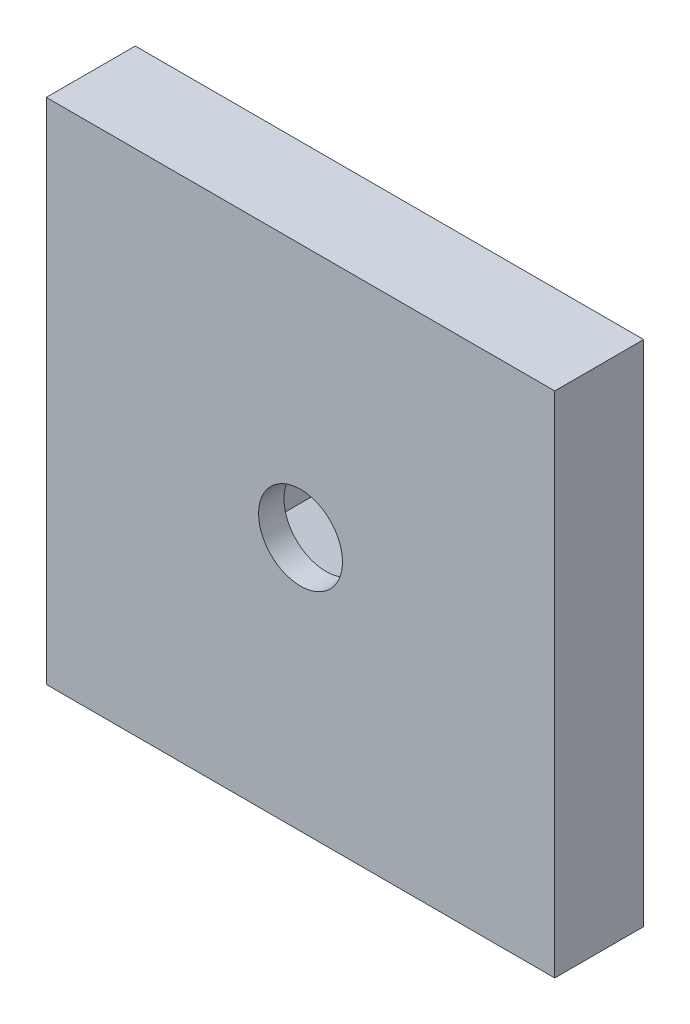
ISO-10303-21;
HEADER;
FILE_DESCRIPTION(('STEP AP214'),'2;1');
FILE_NAME('part.step','',(''),(''),'','','');
FILE_SCHEMA(('AUTOMOTIVE_DESIGN { 1 0 10303 214 1 1 1 1 }'));
ENDSEC;
DATA;
#1=APPLICATION_CONTEXT('core data for automotive mechanical design processes');
#2=APPLICATION_PROTOCOL_DEFINITION('international standard','automotive_design',2000,#1);
#3=PRODUCT_CONTEXT('',#1,'mechanical');
#4=PRODUCT('Part','Part','',(#3));
#5=PRODUCT_RELATED_PRODUCT_CATEGORY('part','',(#4));
#6=PRODUCT_DEFINITION_FORMATION('','',#4);
#7=PRODUCT_DEFINITION_CONTEXT('part definition',#1,'design');
#8=PRODUCT_DEFINITION('design','',#6,#7);
#9=PRODUCT_DEFINITION_SHAPE('','',#8);
#10=(LENGTH_UNIT() NAMED_UNIT(*) SI_UNIT(.MILLI.,.METRE.));
#11=(NAMED_UNIT(*) PLANE_ANGLE_UNIT() SI_UNIT($,.RADIAN.));
#12=(NAMED_UNIT(*) SI_UNIT($,.STERADIAN.) SOLID_ANGLE_UNIT());
#13=UNCERTAINTY_MEASURE_WITH_UNIT(LENGTH_MEASURE(1.E-05),#10,'distance_accuracy_value','');
#14=(GEOMETRIC_REPRESENTATION_CONTEXT(3) GLOBAL_UNCERTAINTY_ASSIGNED_CONTEXT((#13)) GLOBAL_UNIT_ASSIGNED_CONTEXT((#10,
#11,#12)) REPRESENTATION_CONTEXT('',''));
#15=CARTESIAN_POINT('',(0.,0.,0.));
#16=DIRECTION('',(0.,0.,1.));
#17=DIRECTION('',(1.,0.,0.));
#18=AXIS2_PLACEMENT_3D('',#15,#16,#17);
#19=CARTESIAN_POINT('',(0.,0.,0.));
#20=DIRECTION('',(0.,0.,1.));
#21=DIRECTION('',(1.,0.,0.));
#22=AXIS2_PLACEMENT_3D('',#19,#20,#21);
#23=PLANE('',#22);
#24=DIRECTION('',(0.,1.,0.));
#25=VECTOR('',#24,1.);
#26=CARTESIAN_POINT('',(10.,10.,0.));
#27=LINE('',#26,#25);
#28=CARTESIAN_POINT('',(10.,-10.,0.));
#29=VERTEX_POINT('',#28);
#30=CARTESIAN_POINT('',(10.,10.,0.));
#31=VERTEX_POINT('',#30);
#32=EDGE_CURVE('E192',#29,#31,#27,.T.);
#33=ORIENTED_EDGE('',*,*,#32,.F.);
#34=DIRECTION('',(1.,0.,0.));
#35=VECTOR('',#34,1.);
#36=CARTESIAN_POINT('',(-10.,-10.,0.));
#37=LINE('',#36,#35);
#38=CARTESIAN_POINT('',(-10.,-10.,0.));
#39=VERTEX_POINT('',#38);
#40=EDGE_CURVE('E61',#39,#29,#37,.T.);
#41=ORIENTED_EDGE('',*,*,#40,.F.);
#42=DIRECTION('',(0.,-1.,0.));
#43=VECTOR('',#42,1.);
#44=CARTESIAN_POINT('',(-10.,10.,0.));
#45=LINE('',#44,#43);
#46=CARTESIAN_POINT('',(-10.,10.,0.));
#47=VERTEX_POINT('',#46);
#48=EDGE_CURVE('E196',#47,#39,#45,.T.);
#49=ORIENTED_EDGE('',*,*,#48,.F.);
#50=DIRECTION('',(-1.,0.,0.));
#51=VECTOR('',#50,1.);
#52=CARTESIAN_POINT('',(-10.,10.,0.));
#53=LINE('',#52,#51);
#54=EDGE_CURVE('E194',#31,#47,#53,.T.);
#55=ORIENTED_EDGE('',*,*,#54,.F.);
#56=EDGE_LOOP('',(#33,#41,#49,#55));
#57=FACE_BOUND('',#56,.T.);
#58=DIRECTION('',(0.866025403784438,-0.5,0.));
#59=VECTOR('',#58,1.);
#60=CARTESIAN_POINT('',(-2.78,-1.60503374834716,0.));
#61=LINE('',#60,#59);
#62=CARTESIAN_POINT('',(-2.78,-1.60503374834716,0.));
#63=VERTEX_POINT('',#62);
#64=CARTESIAN_POINT('',(0.,-3.21006749669432,0.));
#65=VERTEX_POINT('',#64);
#66=EDGE_CURVE('E53',#63,#65,#61,.T.);
#67=ORIENTED_EDGE('',*,*,#66,.T.);
#68=DIRECTION('',(0.866025403784439,0.5,0.));
#69=VECTOR('',#68,1.);
#70=CARTESIAN_POINT('',(0.,-3.21006749669432,0.));
#71=LINE('',#70,#69);
#72=CARTESIAN_POINT('',(2.78,-1.60503374834716,0.));
#73=VERTEX_POINT('',#72);
#74=EDGE_CURVE('E167',#65,#73,#71,.T.);
#75=ORIENTED_EDGE('',*,*,#74,.T.);
#76=DIRECTION('',(0.,1.,0.));
#77=VECTOR('',#76,1.);
#78=CARTESIAN_POINT('',(2.78,-1.60503374834716,0.));
#79=LINE('',#78,#77);
#80=CARTESIAN_POINT('',(2.78,1.60503374834716,0.));
#81=VERTEX_POINT('',#80);
#82=EDGE_CURVE('E170',#73,#81,#79,.T.);
#83=ORIENTED_EDGE('',*,*,#82,.T.);
#84=DIRECTION('',(-0.866025403784439,0.5,0.));
#85=VECTOR('',#84,1.);
#86=CARTESIAN_POINT('',(2.78,1.60503374834716,0.));
#87=LINE('',#86,#85);
#88=CARTESIAN_POINT('',(0.,3.21006749669432,0.));
#89=VERTEX_POINT('',#88);
#90=EDGE_CURVE('E173',#81,#89,#87,.T.);
#91=ORIENTED_EDGE('',*,*,#90,.T.);
#92=DIRECTION('',(-0.866025403784439,-0.5,0.));
#93=VECTOR('',#92,1.);
#94=CARTESIAN_POINT('',(0.,3.21006749669432,0.));
#95=LINE('',#94,#93);
#96=CARTESIAN_POINT('',(-2.78,1.60503374834716,0.));
#97=VERTEX_POINT('',#96);
#98=EDGE_CURVE('E176',#89,#97,#95,.T.);
#99=ORIENTED_EDGE('',*,*,#98,.T.);
#100=DIRECTION('',(0.,-1.,0.));
#101=VECTOR('',#100,1.);
#102=CARTESIAN_POINT('',(-2.78,1.60503374834716,0.));
#103=LINE('',#102,#101);
#104=EDGE_CURVE('E150',#97,#63,#103,.T.);
#105=ORIENTED_EDGE('',*,*,#104,.T.);
#106=EDGE_LOOP('',(#67,#75,#83,#91,#99,#105));
#107=FACE_BOUND('',#106,.T.);
#108=ADVANCED_FACE('F38',(#57,#107),#23,.F.);
#109=CARTESIAN_POINT('',(10.,10.,2.5));
#110=DIRECTION('',(-1.,0.,0.));
#111=DIRECTION('',(0.,-1.,0.));
#112=AXIS2_PLACEMENT_3D('',#109,#110,#111);
#113=PLANE('',#112);
#114=ORIENTED_EDGE('',*,*,#32,.T.);
#115=DIRECTION('',(0.,0.,-1.));
#116=VECTOR('',#115,1.);
#117=CARTESIAN_POINT('',(10.,10.,2.5));
#118=LINE('',#117,#116);
#119=CARTESIAN_POINT('',(10.,10.,3.5));
#120=VERTEX_POINT('',#119);
#121=EDGE_CURVE('E11',#120,#31,#118,.T.);
#122=ORIENTED_EDGE('',*,*,#121,.F.);
#123=DIRECTION('',(0.,1.,0.));
#124=VECTOR('',#123,1.);
#125=CARTESIAN_POINT('',(10.,-10.,3.5));
#126=LINE('',#125,#124);
#127=CARTESIAN_POINT('',(10.,-10.,3.5));
#128=VERTEX_POINT('',#127);
#129=EDGE_CURVE('E127',#128,#120,#126,.T.);
#130=ORIENTED_EDGE('',*,*,#129,.F.);
#131=DIRECTION('',(0.,0.,-1.));
#132=VECTOR('',#131,1.);
#133=CARTESIAN_POINT('',(10.,-10.,2.5));
#134=LINE('',#133,#132);
#135=EDGE_CURVE('E116',#128,#29,#134,.T.);
#136=ORIENTED_EDGE('',*,*,#135,.T.);
#137=EDGE_LOOP('',(#114,#122,#130,#136));
#138=FACE_BOUND('',#137,.T.);
#139=ADVANCED_FACE('F40',(#138),#113,.F.);
#140=CARTESIAN_POINT('',(-10.,10.,2.5));
#141=DIRECTION('',(0.,-1.,0.));
#142=DIRECTION('',(0.,0.,-1.));
#143=AXIS2_PLACEMENT_3D('',#140,#141,#142);
#144=PLANE('',#143);
#145=ORIENTED_EDGE('',*,*,#54,.T.);
#146=DIRECTION('',(0.,0.,-1.));
#147=VECTOR('',#146,1.);
#148=CARTESIAN_POINT('',(-10.,10.,2.5));
#149=LINE('',#148,#147);
#150=CARTESIAN_POINT('',(-10.,10.,3.5));
#151=VERTEX_POINT('',#150);
#152=EDGE_CURVE('E46',#151,#47,#149,.T.);
#153=ORIENTED_EDGE('',*,*,#152,.F.);
#154=DIRECTION('',(-1.,0.,0.));
#155=VECTOR('',#154,1.);
#156=CARTESIAN_POINT('',(10.,10.,3.5));
#157=LINE('',#156,#155);
#158=EDGE_CURVE('E131',#120,#151,#157,.T.);
#159=ORIENTED_EDGE('',*,*,#158,.F.);
#160=ORIENTED_EDGE('',*,*,#121,.T.);
#161=EDGE_LOOP('',(#145,#153,#159,#160));
#162=FACE_BOUND('',#161,.T.);
#163=ADVANCED_FACE('F206',(#162),#144,.F.);
#164=CARTESIAN_POINT('',(-10.,10.,2.5));
#165=DIRECTION('',(1.,0.,0.));
#166=DIRECTION('',(0.,1.,0.));
#167=AXIS2_PLACEMENT_3D('',#164,#165,#166);
#168=PLANE('',#167);
#169=ORIENTED_EDGE('',*,*,#48,.T.);
#170=DIRECTION('',(0.,0.,-1.));
#171=VECTOR('',#170,1.);
#172=CARTESIAN_POINT('',(-10.,-10.,2.5));
#173=LINE('',#172,#171);
#174=CARTESIAN_POINT('',(-10.,-10.,3.5));
#175=VERTEX_POINT('',#174);
#176=EDGE_CURVE('E124',#175,#39,#173,.T.);
#177=ORIENTED_EDGE('',*,*,#176,.F.);
#178=DIRECTION('',(0.,-1.,0.));
#179=VECTOR('',#178,1.);
#180=CARTESIAN_POINT('',(-10.,10.,3.5));
#181=LINE('',#180,#179);
#182=EDGE_CURVE('E136',#151,#175,#181,.T.);
#183=ORIENTED_EDGE('',*,*,#182,.F.);
#184=ORIENTED_EDGE('',*,*,#152,.T.);
#185=EDGE_LOOP('',(#169,#177,#183,#184));
#186=FACE_BOUND('',#185,.T.);
#187=ADVANCED_FACE('F202',(#186),#168,.F.);
#188=CARTESIAN_POINT('',(-10.,-10.,2.5));
#189=DIRECTION('',(0.,1.,0.));
#190=DIRECTION('',(0.,0.,1.));
#191=AXIS2_PLACEMENT_3D('',#188,#189,#190);
#192=PLANE('',#191);
#193=ORIENTED_EDGE('',*,*,#40,.T.);
#194=ORIENTED_EDGE('',*,*,#135,.F.);
#195=DIRECTION('',(1.,0.,0.));
#196=VECTOR('',#195,1.);
#197=CARTESIAN_POINT('',(-10.,-10.,3.5));
#198=LINE('',#197,#196);
#199=EDGE_CURVE('E120',#175,#128,#198,.T.);
#200=ORIENTED_EDGE('',*,*,#199,.F.);
#201=ORIENTED_EDGE('',*,*,#176,.T.);
#202=EDGE_LOOP('',(#193,#194,#200,#201));
#203=FACE_BOUND('',#202,.T.);
#204=ADVANCED_FACE('F118',(#203),#192,.F.);
#205=CARTESIAN_POINT('',(-2.78,-1.60503374834716,2.5));
#206=DIRECTION('',(0.5,0.866025403784438,0.));
#207=DIRECTION('',(-0.866025403784439,0.5,0.));
#208=AXIS2_PLACEMENT_3D('',#205,#206,#207);
#209=PLANE('',#208);
#210=ORIENTED_EDGE('',*,*,#66,.F.);
#211=DIRECTION('',(0.,0.,-1.));
#212=VECTOR('',#211,1.);
#213=CARTESIAN_POINT('',(-2.78,-1.60503374834716,2.5));
#214=LINE('',#213,#212);
#215=CARTESIAN_POINT('',(-2.78,-1.60503374834716,2.5));
#216=VERTEX_POINT('',#215);
#217=EDGE_CURVE('E165',#216,#63,#214,.T.);
#218=ORIENTED_EDGE('',*,*,#217,.F.);
#219=DIRECTION('',(0.866025403784438,-0.5,0.));
#220=VECTOR('',#219,1.);
#221=CARTESIAN_POINT('',(-2.78,-1.60503374834716,2.5));
#222=LINE('',#221,#220);
#223=CARTESIAN_POINT('',(0.,-3.21006749669432,2.5));
#224=VERTEX_POINT('',#223);
#225=EDGE_CURVE('E146',#216,#224,#222,.T.);
#226=ORIENTED_EDGE('',*,*,#225,.T.);
#227=DIRECTION('',(0.,0.,-1.));
#228=VECTOR('',#227,1.);
#229=CARTESIAN_POINT('',(0.,-3.21006749669432,2.5));
#230=LINE('',#229,#228);
#231=EDGE_CURVE('E190',#224,#65,#230,.T.);
#232=ORIENTED_EDGE('',*,*,#231,.T.);
#233=EDGE_LOOP('',(#210,#218,#226,#232));
#234=FACE_BOUND('',#233,.T.);
#235=ADVANCED_FACE('F219',(#234),#209,.T.);
#236=CARTESIAN_POINT('',(0.,-3.21006749669432,2.5));
#237=DIRECTION('',(-0.5,0.866025403784439,0.));
#238=DIRECTION('',(-0.866025403784439,-0.5,0.));
#239=AXIS2_PLACEMENT_3D('',#236,#237,#238);
#240=PLANE('',#239);
#241=ORIENTED_EDGE('',*,*,#74,.F.);
#242=ORIENTED_EDGE('',*,*,#231,.F.);
#243=DIRECTION('',(0.866025403784439,0.5,0.));
#244=VECTOR('',#243,1.);
#245=CARTESIAN_POINT('',(0.,-3.21006749669432,2.5));
#246=LINE('',#245,#244);
#247=CARTESIAN_POINT('',(2.78,-1.60503374834716,2.5));
#248=VERTEX_POINT('',#247);
#249=EDGE_CURVE('E149',#224,#248,#246,.T.);
#250=ORIENTED_EDGE('',*,*,#249,.T.);
#251=DIRECTION('',(0.,0.,-1.));
#252=VECTOR('',#251,1.);
#253=CARTESIAN_POINT('',(2.78,-1.60503374834716,2.5));
#254=LINE('',#253,#252);
#255=EDGE_CURVE('E188',#248,#73,#254,.T.);
#256=ORIENTED_EDGE('',*,*,#255,.T.);
#257=EDGE_LOOP('',(#241,#242,#250,#256));
#258=FACE_BOUND('',#257,.T.);
#259=ADVANCED_FACE('F225',(#258),#240,.T.);
#260=CARTESIAN_POINT('',(2.78,-1.60503374834716,2.5));
#261=DIRECTION('',(-1.,0.,0.));
#262=DIRECTION('',(0.,0.,1.));
#263=AXIS2_PLACEMENT_3D('',#260,#261,#262);
#264=PLANE('',#263);
#265=ORIENTED_EDGE('',*,*,#82,.F.);
#266=ORIENTED_EDGE('',*,*,#255,.F.);
#267=DIRECTION('',(0.,1.,0.));
#268=VECTOR('',#267,1.);
#269=CARTESIAN_POINT('',(2.78,-1.60503374834716,2.5));
#270=LINE('',#269,#268);
#271=CARTESIAN_POINT('',(2.78,1.60503374834716,2.5));
#272=VERTEX_POINT('',#271);
#273=EDGE_CURVE('E153',#248,#272,#270,.T.);
#274=ORIENTED_EDGE('',*,*,#273,.T.);
#275=DIRECTION('',(0.,0.,-1.));
#276=VECTOR('',#275,1.);
#277=CARTESIAN_POINT('',(2.78,1.60503374834716,2.5));
#278=LINE('',#277,#276);
#279=EDGE_CURVE('E186',#272,#81,#278,.T.);
#280=ORIENTED_EDGE('',*,*,#279,.T.);
#281=EDGE_LOOP('',(#265,#266,#274,#280));
#282=FACE_BOUND('',#281,.T.);
#283=ADVANCED_FACE('F229',(#282),#264,.T.);
#284=CARTESIAN_POINT('',(2.78,1.60503374834716,2.5));
#285=DIRECTION('',(-0.5,-0.866025403784439,0.));
#286=DIRECTION('',(0.866025403784439,-0.5,0.));
#287=AXIS2_PLACEMENT_3D('',#284,#285,#286);
#288=PLANE('',#287);
#289=ORIENTED_EDGE('',*,*,#90,.F.);
#290=ORIENTED_EDGE('',*,*,#279,.F.);
#291=DIRECTION('',(-0.866025403784439,0.5,0.));
#292=VECTOR('',#291,1.);
#293=CARTESIAN_POINT('',(2.78,1.60503374834716,2.5));
#294=LINE('',#293,#292);
#295=CARTESIAN_POINT('',(0.,3.21006749669432,2.5));
#296=VERTEX_POINT('',#295);
#297=EDGE_CURVE('E156',#272,#296,#294,.T.);
#298=ORIENTED_EDGE('',*,*,#297,.T.);
#299=DIRECTION('',(0.,0.,-1.));
#300=VECTOR('',#299,1.);
#301=CARTESIAN_POINT('',(0.,3.21006749669432,2.5));
#302=LINE('',#301,#300);
#303=EDGE_CURVE('E184',#296,#89,#302,.T.);
#304=ORIENTED_EDGE('',*,*,#303,.T.);
#305=EDGE_LOOP('',(#289,#290,#298,#304));
#306=FACE_BOUND('',#305,.T.);
#307=ADVANCED_FACE('F234',(#306),#288,.T.);
#308=CARTESIAN_POINT('',(0.,3.21006749669432,2.5));
#309=DIRECTION('',(0.5,-0.866025403784439,0.));
#310=DIRECTION('',(0.866025403784439,0.5,0.));
#311=AXIS2_PLACEMENT_3D('',#308,#309,#310);
#312=PLANE('',#311);
#313=ORIENTED_EDGE('',*,*,#98,.F.);
#314=ORIENTED_EDGE('',*,*,#303,.F.);
#315=DIRECTION('',(-0.866025403784439,-0.5,0.));
#316=VECTOR('',#315,1.);
#317=CARTESIAN_POINT('',(0.,3.21006749669432,2.5));
#318=LINE('',#317,#316);
#319=CARTESIAN_POINT('',(-2.78,1.60503374834716,2.5));
#320=VERTEX_POINT('',#319);
#321=EDGE_CURVE('E159',#296,#320,#318,.T.);
#322=ORIENTED_EDGE('',*,*,#321,.T.);
#323=DIRECTION('',(0.,0.,-1.));
#324=VECTOR('',#323,1.);
#325=CARTESIAN_POINT('',(-2.78,1.60503374834716,2.5));
#326=LINE('',#325,#324);
#327=EDGE_CURVE('E182',#320,#97,#326,.T.);
#328=ORIENTED_EDGE('',*,*,#327,.T.);
#329=EDGE_LOOP('',(#313,#314,#322,#328));
#330=FACE_BOUND('',#329,.T.);
#331=ADVANCED_FACE('F240',(#330),#312,.T.);
#332=CARTESIAN_POINT('',(-2.78,1.60503374834716,2.5));
#333=DIRECTION('',(1.,0.,0.));
#334=DIRECTION('',(0.,0.,-1.));
#335=AXIS2_PLACEMENT_3D('',#332,#333,#334);
#336=PLANE('',#335);
#337=ORIENTED_EDGE('',*,*,#104,.F.);
#338=ORIENTED_EDGE('',*,*,#327,.F.);
#339=DIRECTION('',(0.,-1.,0.));
#340=VECTOR('',#339,1.);
#341=CARTESIAN_POINT('',(-2.78,1.60503374834716,2.5));
#342=LINE('',#341,#340);
#343=EDGE_CURVE('E162',#320,#216,#342,.T.);
#344=ORIENTED_EDGE('',*,*,#343,.T.);
#345=ORIENTED_EDGE('',*,*,#217,.T.);
#346=EDGE_LOOP('',(#337,#338,#344,#345));
#347=FACE_BOUND('',#346,.T.);
#348=ADVANCED_FACE('F244',(#347),#336,.T.);
#349=CARTESIAN_POINT('',(0.,0.,2.5));
#350=DIRECTION('',(0.,0.,1.));
#351=DIRECTION('',(1.,0.,0.));
#352=AXIS2_PLACEMENT_3D('',#349,#350,#351);
#353=PLANE('',#352);
#354=CARTESIAN_POINT('',(0.,0.,2.5));
#355=DIRECTION('',(0.,0.,1.));
#356=DIRECTION('',(1.,0.,0.));
#357=AXIS2_PLACEMENT_3D('',#354,#355,#356);
#358=CIRCLE('',#357,1.65);
#359=CARTESIAN_POINT('',(1.65,0.,2.5));
#360=VERTEX_POINT('',#359);
#361=EDGE_CURVE('E137',#360,#360,#358,.T.);
#362=ORIENTED_EDGE('',*,*,#361,.T.);
#363=EDGE_LOOP('',(#362));
#364=FACE_BOUND('',#363,.T.);
#365=ORIENTED_EDGE('',*,*,#249,.F.);
#366=ORIENTED_EDGE('',*,*,#225,.F.);
#367=ORIENTED_EDGE('',*,*,#343,.F.);
#368=ORIENTED_EDGE('',*,*,#321,.F.);
#369=ORIENTED_EDGE('',*,*,#297,.F.);
#370=ORIENTED_EDGE('',*,*,#273,.F.);
#371=EDGE_LOOP('',(#365,#366,#367,#368,#369,#370));
#372=FACE_BOUND('',#371,.T.);
#373=ADVANCED_FACE('F248',(#364,#372),#353,.F.);
#374=CARTESIAN_POINT('',(0.,0.,3.5));
#375=DIRECTION('',(0.,0.,1.));
#376=DIRECTION('',(1.,0.,0.));
#377=AXIS2_PLACEMENT_3D('',#374,#375,#376);
#378=PLANE('',#377);
#379=CARTESIAN_POINT('',(0.,0.,3.5));
#380=DIRECTION('',(0.,0.,-1.));
#381=DIRECTION('',(-1.,0.,0.));
#382=AXIS2_PLACEMENT_3D('',#379,#380,#381);
#383=CIRCLE('',#382,1.65);
#384=CARTESIAN_POINT('',(-1.65,0.,3.5));
#385=VERTEX_POINT('',#384);
#386=EDGE_CURVE('E140',#385,#385,#383,.T.);
#387=ORIENTED_EDGE('',*,*,#386,.T.);
#388=EDGE_LOOP('',(#387));
#389=FACE_BOUND('',#388,.T.);
#390=ORIENTED_EDGE('',*,*,#199,.T.);
#391=ORIENTED_EDGE('',*,*,#129,.T.);
#392=ORIENTED_EDGE('',*,*,#158,.T.);
#393=ORIENTED_EDGE('',*,*,#182,.T.);
#394=EDGE_LOOP('',(#390,#391,#392,#393));
#395=FACE_BOUND('',#394,.T.);
#396=ADVANCED_FACE('F134',(#389,#395),#378,.T.);
#397=CARTESIAN_POINT('',(0.,0.,3.5));
#398=DIRECTION('',(0.,0.,-1.));
#399=DIRECTION('',(-1.,0.,0.));
#400=AXIS2_PLACEMENT_3D('',#397,#398,#399);
#401=CYLINDRICAL_SURFACE('',#400,1.65);
#402=ORIENTED_EDGE('',*,*,#386,.F.);
#403=EDGE_LOOP('',(#402));
#404=FACE_BOUND('',#403,.T.);
#405=ORIENTED_EDGE('',*,*,#361,.F.);
#406=EDGE_LOOP('',(#405));
#407=FACE_BOUND('',#406,.T.);
#408=ADVANCED_FACE('F255',(#404,#407),#401,.F.);
#409=CLOSED_SHELL('',(#108,#139,#163,#187,#204,#235,#259,#283,#307,#331,#348,#373,#396,#408));
#410=MANIFOLD_SOLID_BREP('B2',#409);
#411=ADVANCED_BREP_SHAPE_REPRESENTATION('',(#18,#410),#14);
#412=SHAPE_DEFINITION_REPRESENTATION(#9,#411);
ENDSEC;
END-ISO-10303-21;
